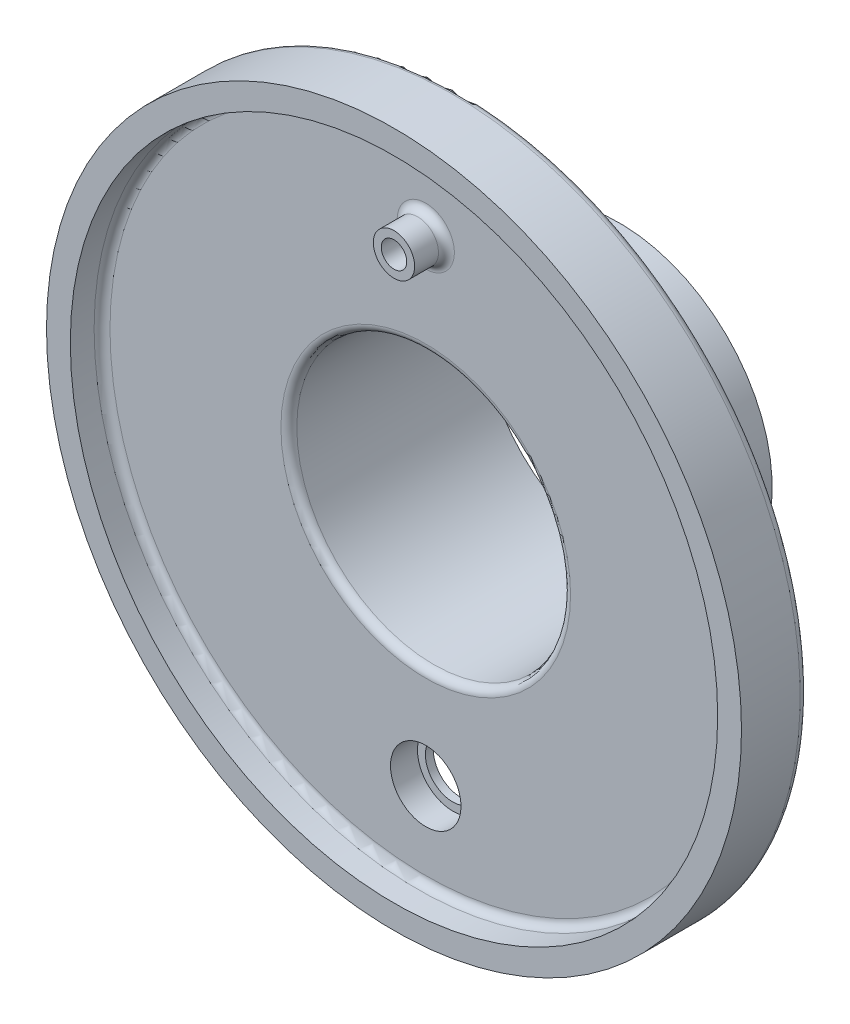
ISO-10303-21;
HEADER;
FILE_DESCRIPTION(('STEP AP214'),'2;1');
FILE_NAME('part.step','',(''),(''),'','','');
FILE_SCHEMA(('AUTOMOTIVE_DESIGN { 1 0 10303 214 1 1 1 1 }'));
ENDSEC;
DATA;
#1=APPLICATION_CONTEXT('core data for automotive mechanical design processes');
#2=APPLICATION_PROTOCOL_DEFINITION('international standard','automotive_design',2000,#1);
#3=PRODUCT_CONTEXT('',#1,'mechanical');
#4=PRODUCT('Part','Part','',(#3));
#5=PRODUCT_RELATED_PRODUCT_CATEGORY('part','',(#4));
#6=PRODUCT_DEFINITION_FORMATION('','',#4);
#7=PRODUCT_DEFINITION_CONTEXT('part definition',#1,'design');
#8=PRODUCT_DEFINITION('design','',#6,#7);
#9=PRODUCT_DEFINITION_SHAPE('','',#8);
#10=(LENGTH_UNIT() NAMED_UNIT(*) SI_UNIT(.MILLI.,.METRE.));
#11=(NAMED_UNIT(*) PLANE_ANGLE_UNIT() SI_UNIT($,.RADIAN.));
#12=(NAMED_UNIT(*) SI_UNIT($,.STERADIAN.) SOLID_ANGLE_UNIT());
#13=UNCERTAINTY_MEASURE_WITH_UNIT(LENGTH_MEASURE(1.E-05),#10,'distance_accuracy_value','');
#14=(GEOMETRIC_REPRESENTATION_CONTEXT(3) GLOBAL_UNCERTAINTY_ASSIGNED_CONTEXT((#13)) GLOBAL_UNIT_ASSIGNED_CONTEXT((#10,
#11,#12)) REPRESENTATION_CONTEXT('',''));
#15=CARTESIAN_POINT('',(0.,0.,0.));
#16=DIRECTION('',(0.,0.,1.));
#17=DIRECTION('',(1.,0.,0.));
#18=AXIS2_PLACEMENT_3D('',#15,#16,#17);
#19=CARTESIAN_POINT('',(0.,-76.2,39.624));
#20=DIRECTION('',(0.,0.,-1.));
#21=DIRECTION('',(-1.,0.,0.));
#22=AXIS2_PLACEMENT_3D('',#19,#20,#21);
#23=CYLINDRICAL_SURFACE('',#22,11.2776);
#24=CARTESIAN_POINT('',(0.,-76.2,0.));
#25=DIRECTION('',(0.,0.,-1.));
#26=DIRECTION('',(-1.,0.,0.));
#27=AXIS2_PLACEMENT_3D('',#24,#25,#26);
#28=CIRCLE('',#27,11.2776);
#29=CARTESIAN_POINT('',(-11.2776,-76.2,0.));
#30=VERTEX_POINT('',#29);
#31=EDGE_CURVE('E77',#30,#30,#28,.T.);
#32=ORIENTED_EDGE('',*,*,#31,.F.);
#33=EDGE_LOOP('',(#32));
#34=FACE_BOUND('',#33,.T.);
#35=CARTESIAN_POINT('',(0.,-76.2,-8.636));
#36=DIRECTION('',(0.,0.,-1.));
#37=DIRECTION('',(-1.,0.,0.));
#38=AXIS2_PLACEMENT_3D('',#35,#36,#37);
#39=CIRCLE('',#38,11.2776);
#40=CARTESIAN_POINT('',(-11.2776,-76.2,-8.636));
#41=VERTEX_POINT('',#40);
#42=EDGE_CURVE('E11',#41,#41,#39,.F.);
#43=ORIENTED_EDGE('',*,*,#42,.F.);
#44=EDGE_LOOP('',(#43));
#45=FACE_BOUND('',#44,.T.);
#46=ADVANCED_FACE('F46',(#34,#45),#23,.F.);
#47=CARTESIAN_POINT('',(0.,0.,-11.176));
#48=DIRECTION('',(0.,0.,-1.));
#49=DIRECTION('',(-1.,0.,0.));
#50=AXIS2_PLACEMENT_3D('',#47,#48,#49);
#51=PLANE('',#50);
#52=CARTESIAN_POINT('',(0.,0.,-11.176));
#53=DIRECTION('',(0.,0.,-1.));
#54=DIRECTION('',(-1.,0.,0.));
#55=AXIS2_PLACEMENT_3D('',#52,#53,#54);
#56=CIRCLE('',#55,51.435);
#57=CARTESIAN_POINT('',(-51.435,0.,-11.176));
#58=VERTEX_POINT('',#57);
#59=EDGE_CURVE('E95',#58,#58,#56,.F.);
#60=ORIENTED_EDGE('',*,*,#59,.T.);
#61=EDGE_LOOP('',(#60));
#62=FACE_BOUND('',#61,.T.);
#63=CARTESIAN_POINT('',(0.,0.,-11.176));
#64=DIRECTION('',(0.,0.,-1.));
#65=DIRECTION('',(-1.,0.,0.));
#66=AXIS2_PLACEMENT_3D('',#63,#64,#65);
#67=CIRCLE('',#66,108.6739);
#68=CARTESIAN_POINT('',(-108.6739,0.,-11.176));
#69=VERTEX_POINT('',#68);
#70=EDGE_CURVE('E99',#69,#69,#67,.T.);
#71=ORIENTED_EDGE('',*,*,#70,.T.);
#72=EDGE_LOOP('',(#71));
#73=FACE_BOUND('',#72,.T.);
#74=CARTESIAN_POINT('',(0.,-76.2,-11.176));
#75=DIRECTION('',(0.,0.,-1.));
#76=DIRECTION('',(-1.,0.,0.));
#77=AXIS2_PLACEMENT_3D('',#74,#75,#76);
#78=CIRCLE('',#77,8.7376);
#79=CARTESIAN_POINT('',(-8.7376,-76.2,-11.176));
#80=VERTEX_POINT('',#79);
#81=EDGE_CURVE('E119',#80,#80,#78,.T.);
#82=ORIENTED_EDGE('',*,*,#81,.F.);
#83=EDGE_LOOP('',(#82));
#84=FACE_BOUND('',#83,.T.);
#85=ADVANCED_FACE('F142',(#62,#73,#84),#51,.T.);
#86=CARTESIAN_POINT('',(0.,0.,10.16));
#87=DIRECTION('',(0.,0.,1.));
#88=DIRECTION('',(1.,0.,0.));
#89=AXIS2_PLACEMENT_3D('',#86,#87,#88);
#90=PLANE('',#89);
#91=CARTESIAN_POINT('',(0.,0.,10.16));
#92=DIRECTION('',(0.,0.,1.));
#93=DIRECTION('',(1.,0.,0.));
#94=AXIS2_PLACEMENT_3D('',#91,#92,#93);
#95=CIRCLE('',#94,111.2139);
#96=CARTESIAN_POINT('',(111.2139,0.,10.16));
#97=VERTEX_POINT('',#96);
#98=EDGE_CURVE('E219',#97,#97,#95,.T.);
#99=ORIENTED_EDGE('',*,*,#98,.T.);
#100=EDGE_LOOP('',(#99));
#101=FACE_BOUND('',#100,.T.);
#102=CARTESIAN_POINT('',(0.,0.,10.16));
#103=DIRECTION('',(0.,0.,1.));
#104=DIRECTION('',(1.,0.,0.));
#105=AXIS2_PLACEMENT_3D('',#102,#103,#104);
#106=CIRCLE('',#105,103.5939);
#107=CARTESIAN_POINT('',(103.5939,0.,10.16));
#108=VERTEX_POINT('',#107);
#109=EDGE_CURVE('E225',#108,#108,#106,.T.);
#110=ORIENTED_EDGE('',*,*,#109,.F.);
#111=EDGE_LOOP('',(#110));
#112=FACE_BOUND('',#111,.T.);
#113=ADVANCED_FACE('F144',(#101,#112),#90,.T.);
#114=CARTESIAN_POINT('',(0.,0.,10.16));
#115=DIRECTION('',(0.,0.,-1.));
#116=DIRECTION('',(-1.,0.,0.));
#117=AXIS2_PLACEMENT_3D('',#114,#115,#116);
#118=CYLINDRICAL_SURFACE('',#117,111.2139);
#119=CARTESIAN_POINT('',(0.,0.,-8.636));
#120=DIRECTION('',(0.,0.,-1.));
#121=DIRECTION('',(-1.,0.,0.));
#122=AXIS2_PLACEMENT_3D('',#119,#120,#121);
#123=CIRCLE('',#122,111.2139);
#124=CARTESIAN_POINT('',(-111.2139,0.,-8.636));
#125=VERTEX_POINT('',#124);
#126=EDGE_CURVE('E91',#125,#125,#123,.F.);
#127=ORIENTED_EDGE('',*,*,#126,.T.);
#128=EDGE_LOOP('',(#127));
#129=FACE_BOUND('',#128,.T.);
#130=ORIENTED_EDGE('',*,*,#98,.F.);
#131=EDGE_LOOP('',(#130));
#132=FACE_BOUND('',#131,.T.);
#133=ADVANCED_FACE('F151',(#129,#132),#118,.T.);
#134=CARTESIAN_POINT('',(0.,0.,10.16));
#135=DIRECTION('',(0.,0.,-1.));
#136=DIRECTION('',(-1.,0.,0.));
#137=AXIS2_PLACEMENT_3D('',#134,#135,#136);
#138=CYLINDRICAL_SURFACE('',#137,103.5939);
#139=CARTESIAN_POINT('',(0.,0.,2.54));
#140=DIRECTION('',(0.,0.,-1.));
#141=DIRECTION('',(-1.,0.,0.));
#142=AXIS2_PLACEMENT_3D('',#139,#140,#141);
#143=CIRCLE('',#142,103.5939);
#144=CARTESIAN_POINT('',(-103.5939,0.,2.54));
#145=VERTEX_POINT('',#144);
#146=EDGE_CURVE('E218',#145,#145,#143,.T.);
#147=ORIENTED_EDGE('',*,*,#146,.T.);
#148=EDGE_LOOP('',(#147));
#149=FACE_BOUND('',#148,.T.);
#150=ORIENTED_EDGE('',*,*,#109,.T.);
#151=EDGE_LOOP('',(#150));
#152=FACE_BOUND('',#151,.T.);
#153=ADVANCED_FACE('F171',(#149,#152),#138,.F.);
#154=CARTESIAN_POINT('',(0.,0.,0.));
#155=DIRECTION('',(0.,0.,-1.));
#156=DIRECTION('',(-1.,0.,0.));
#157=AXIS2_PLACEMENT_3D('',#154,#155,#156);
#158=PLANE('',#157);
#159=CARTESIAN_POINT('',(0.,76.2,0.));
#160=DIRECTION('',(0.,0.,-1.));
#161=DIRECTION('',(-1.,0.,0.));
#162=AXIS2_PLACEMENT_3D('',#159,#160,#161);
#163=CIRCLE('',#162,9.1567);
#164=CARTESIAN_POINT('',(-9.1567,76.2,0.));
#165=VERTEX_POINT('',#164);
#166=EDGE_CURVE('E55',#165,#165,#163,.T.);
#167=ORIENTED_EDGE('',*,*,#166,.T.);
#168=EDGE_LOOP('',(#167));
#169=FACE_BOUND('',#168,.T.);
#170=ORIENTED_EDGE('',*,*,#31,.T.);
#171=EDGE_LOOP('',(#170));
#172=FACE_BOUND('',#171,.T.);
#173=CARTESIAN_POINT('',(0.,0.,0.));
#174=DIRECTION('',(0.,0.,-1.));
#175=DIRECTION('',(-1.,0.,0.));
#176=AXIS2_PLACEMENT_3D('',#173,#174,#175);
#177=CIRCLE('',#176,46.355);
#178=CARTESIAN_POINT('',(-46.355,0.,0.));
#179=VERTEX_POINT('',#178);
#180=EDGE_CURVE('E86',#179,#179,#177,.T.);
#181=ORIENTED_EDGE('',*,*,#180,.T.);
#182=EDGE_LOOP('',(#181));
#183=FACE_BOUND('',#182,.T.);
#184=CARTESIAN_POINT('',(0.,0.,0.));
#185=DIRECTION('',(0.,0.,-1.));
#186=DIRECTION('',(-1.,0.,0.));
#187=AXIS2_PLACEMENT_3D('',#184,#185,#186);
#188=CIRCLE('',#187,101.0539);
#189=CARTESIAN_POINT('',(-101.0539,0.,0.));
#190=VERTEX_POINT('',#189);
#191=EDGE_CURVE('E215',#190,#190,#188,.F.);
#192=ORIENTED_EDGE('',*,*,#191,.T.);
#193=EDGE_LOOP('',(#192));
#194=FACE_BOUND('',#193,.T.);
#195=ADVANCED_FACE('F166',(#169,#172,#183,#194),#158,.F.);
#196=CARTESIAN_POINT('',(0.,0.,-11.176));
#197=DIRECTION('',(0.,0.,1.));
#198=DIRECTION('',(1.,0.,0.));
#199=AXIS2_PLACEMENT_3D('',#196,#197,#198);
#200=CYLINDRICAL_SURFACE('',#199,43.815);
#201=CARTESIAN_POINT('',(0.,0.,-2.54));
#202=DIRECTION('',(0.,0.,-1.));
#203=DIRECTION('',(-1.,0.,0.));
#204=AXIS2_PLACEMENT_3D('',#201,#202,#203);
#205=CIRCLE('',#204,43.815);
#206=CARTESIAN_POINT('',(-43.815,0.,-2.54));
#207=VERTEX_POINT('',#206);
#208=EDGE_CURVE('E65',#207,#207,#205,.F.);
#209=ORIENTED_EDGE('',*,*,#208,.T.);
#210=EDGE_LOOP('',(#209));
#211=FACE_BOUND('',#210,.T.);
#212=CARTESIAN_POINT('',(0.,0.,-61.976));
#213=DIRECTION('',(0.,0.,-1.));
#214=DIRECTION('',(-1.,0.,0.));
#215=AXIS2_PLACEMENT_3D('',#212,#213,#214);
#216=CIRCLE('',#215,43.815);
#217=CARTESIAN_POINT('',(-43.815,0.,-61.976));
#218=VERTEX_POINT('',#217);
#219=EDGE_CURVE('E82',#218,#218,#216,.T.);
#220=ORIENTED_EDGE('',*,*,#219,.T.);
#221=EDGE_LOOP('',(#220));
#222=FACE_BOUND('',#221,.T.);
#223=ADVANCED_FACE('F163',(#211,#222),#200,.F.);
#224=CARTESIAN_POINT('',(0.,0.,-61.976));
#225=DIRECTION('',(0.,0.,-1.));
#226=DIRECTION('',(-1.,0.,0.));
#227=AXIS2_PLACEMENT_3D('',#224,#225,#226);
#228=PLANE('',#227);
#229=CARTESIAN_POINT('',(0.,0.,-61.976));
#230=DIRECTION('',(0.,0.,-1.));
#231=DIRECTION('',(-1.,0.,0.));
#232=AXIS2_PLACEMENT_3D('',#229,#230,#231);
#233=CIRCLE('',#232,48.895);
#234=CARTESIAN_POINT('',(-48.895,0.,-61.976));
#235=VERTEX_POINT('',#234);
#236=EDGE_CURVE('E235',#235,#235,#233,.T.);
#237=ORIENTED_EDGE('',*,*,#236,.T.);
#238=EDGE_LOOP('',(#237));
#239=FACE_BOUND('',#238,.T.);
#240=ORIENTED_EDGE('',*,*,#219,.F.);
#241=EDGE_LOOP('',(#240));
#242=FACE_BOUND('',#241,.T.);
#243=ADVANCED_FACE('F247',(#239,#242),#228,.T.);
#244=CARTESIAN_POINT('',(0.,0.,-61.976));
#245=DIRECTION('',(0.,0.,1.));
#246=DIRECTION('',(1.,0.,0.));
#247=AXIS2_PLACEMENT_3D('',#244,#245,#246);
#248=CYLINDRICAL_SURFACE('',#247,48.895);
#249=CARTESIAN_POINT('',(0.,0.,-13.716));
#250=DIRECTION('',(0.,0.,-1.));
#251=DIRECTION('',(-1.,0.,0.));
#252=AXIS2_PLACEMENT_3D('',#249,#250,#251);
#253=CIRCLE('',#252,48.895);
#254=CARTESIAN_POINT('',(-48.895,0.,-13.716));
#255=VERTEX_POINT('',#254);
#256=EDGE_CURVE('E104',#255,#255,#253,.T.);
#257=ORIENTED_EDGE('',*,*,#256,.T.);
#258=EDGE_LOOP('',(#257));
#259=FACE_BOUND('',#258,.T.);
#260=ORIENTED_EDGE('',*,*,#236,.F.);
#261=EDGE_LOOP('',(#260));
#262=FACE_BOUND('',#261,.T.);
#263=ADVANCED_FACE('F187',(#259,#262),#248,.T.);
#264=CARTESIAN_POINT('',(0.,0.,2.54));
#265=DIRECTION('',(0.,0.,-1.));
#266=DIRECTION('',(-1.,0.,0.));
#267=AXIS2_PLACEMENT_3D('',#264,#265,#266);
#268=TOROIDAL_SURFACE('',#267,101.0539,2.54);
#269=ORIENTED_EDGE('',*,*,#146,.F.);
#270=EDGE_LOOP('',(#269));
#271=FACE_BOUND('',#270,.T.);
#272=ORIENTED_EDGE('',*,*,#191,.F.);
#273=EDGE_LOOP('',(#272));
#274=FACE_BOUND('',#273,.T.);
#275=ADVANCED_FACE('F182',(#271,#274),#268,.F.);
#276=CARTESIAN_POINT('',(0.,0.,-13.716));
#277=DIRECTION('',(0.,0.,-1.));
#278=DIRECTION('',(-1.,0.,0.));
#279=AXIS2_PLACEMENT_3D('',#276,#277,#278);
#280=TOROIDAL_SURFACE('',#279,51.435,2.54);
#281=ORIENTED_EDGE('',*,*,#59,.F.);
#282=EDGE_LOOP('',(#281));
#283=FACE_BOUND('',#282,.T.);
#284=ORIENTED_EDGE('',*,*,#256,.F.);
#285=EDGE_LOOP('',(#284));
#286=FACE_BOUND('',#285,.T.);
#287=ADVANCED_FACE('F186',(#283,#286),#280,.F.);
#288=CARTESIAN_POINT('',(0.,0.,-8.636));
#289=DIRECTION('',(0.,0.,-1.));
#290=DIRECTION('',(-1.,0.,0.));
#291=AXIS2_PLACEMENT_3D('',#288,#289,#290);
#292=TOROIDAL_SURFACE('',#291,108.6739,2.54);
#293=ORIENTED_EDGE('',*,*,#126,.F.);
#294=EDGE_LOOP('',(#293));
#295=FACE_BOUND('',#294,.T.);
#296=ORIENTED_EDGE('',*,*,#70,.F.);
#297=EDGE_LOOP('',(#296));
#298=FACE_BOUND('',#297,.T.);
#299=ADVANCED_FACE('F192',(#295,#298),#292,.T.);
#300=CARTESIAN_POINT('',(0.,0.,-2.54));
#301=DIRECTION('',(0.,0.,-1.));
#302=DIRECTION('',(-1.,0.,0.));
#303=AXIS2_PLACEMENT_3D('',#300,#301,#302);
#304=TOROIDAL_SURFACE('',#303,46.355,2.54);
#305=ORIENTED_EDGE('',*,*,#208,.F.);
#306=EDGE_LOOP('',(#305));
#307=FACE_BOUND('',#306,.T.);
#308=ORIENTED_EDGE('',*,*,#180,.F.);
#309=EDGE_LOOP('',(#308));
#310=FACE_BOUND('',#309,.T.);
#311=ADVANCED_FACE('F195',(#307,#310),#304,.T.);
#312=CARTESIAN_POINT('',(0.,76.2,10.16));
#313=DIRECTION('',(0.,0.,-1.));
#314=DIRECTION('',(-1.,0.,0.));
#315=AXIS2_PLACEMENT_3D('',#312,#313,#314);
#316=CYLINDRICAL_SURFACE('',#315,4.0767);
#317=CARTESIAN_POINT('',(0.,76.2,10.16));
#318=DIRECTION('',(0.,0.,1.));
#319=DIRECTION('',(1.,0.,0.));
#320=AXIS2_PLACEMENT_3D('',#317,#318,#319);
#321=CIRCLE('',#320,4.0767);
#322=CARTESIAN_POINT('',(4.0767,76.2,10.16));
#323=VERTEX_POINT('',#322);
#324=EDGE_CURVE('E112',#323,#323,#321,.T.);
#325=ORIENTED_EDGE('',*,*,#324,.T.);
#326=EDGE_LOOP('',(#325));
#327=FACE_BOUND('',#326,.T.);
#328=CARTESIAN_POINT('',(0.,76.2,0.));
#329=DIRECTION('',(0.,0.,1.));
#330=DIRECTION('',(1.,0.,0.));
#331=AXIS2_PLACEMENT_3D('',#328,#329,#330);
#332=CIRCLE('',#331,4.0767);
#333=CARTESIAN_POINT('',(4.0767,76.2,0.));
#334=VERTEX_POINT('',#333);
#335=EDGE_CURVE('E118',#334,#334,#332,.T.);
#336=ORIENTED_EDGE('',*,*,#335,.F.);
#337=EDGE_LOOP('',(#336));
#338=FACE_BOUND('',#337,.T.);
#339=ADVANCED_FACE('F200',(#327,#338),#316,.F.);
#340=CARTESIAN_POINT('',(0.,76.2,10.16));
#341=DIRECTION('',(0.,0.,-1.));
#342=DIRECTION('',(-1.,0.,0.));
#343=AXIS2_PLACEMENT_3D('',#340,#341,#342);
#344=CYLINDRICAL_SURFACE('',#343,6.6167);
#345=CARTESIAN_POINT('',(0.,76.2,2.54));
#346=DIRECTION('',(0.,0.,-1.));
#347=DIRECTION('',(-1.,0.,0.));
#348=AXIS2_PLACEMENT_3D('',#345,#346,#347);
#349=CIRCLE('',#348,6.6167);
#350=CARTESIAN_POINT('',(-6.6167,76.2,2.54));
#351=VERTEX_POINT('',#350);
#352=EDGE_CURVE('E60',#351,#351,#349,.F.);
#353=ORIENTED_EDGE('',*,*,#352,.T.);
#354=EDGE_LOOP('',(#353));
#355=FACE_BOUND('',#354,.T.);
#356=CARTESIAN_POINT('',(0.,76.2,10.16));
#357=DIRECTION('',(0.,0.,1.));
#358=DIRECTION('',(1.,0.,0.));
#359=AXIS2_PLACEMENT_3D('',#356,#357,#358);
#360=CIRCLE('',#359,6.6167);
#361=CARTESIAN_POINT('',(6.6167,76.2,10.16));
#362=VERTEX_POINT('',#361);
#363=EDGE_CURVE('E83',#362,#362,#360,.T.);
#364=ORIENTED_EDGE('',*,*,#363,.F.);
#365=EDGE_LOOP('',(#364));
#366=FACE_BOUND('',#365,.T.);
#367=ADVANCED_FACE('F205',(#355,#366),#344,.T.);
#368=CARTESIAN_POINT('',(0.,0.,10.16));
#369=DIRECTION('',(0.,0.,1.));
#370=DIRECTION('',(1.,0.,0.));
#371=AXIS2_PLACEMENT_3D('',#368,#369,#370);
#372=PLANE('',#371);
#373=ORIENTED_EDGE('',*,*,#324,.F.);
#374=EDGE_LOOP('',(#373));
#375=FACE_BOUND('',#374,.T.);
#376=ORIENTED_EDGE('',*,*,#363,.T.);
#377=EDGE_LOOP('',(#376));
#378=FACE_BOUND('',#377,.T.);
#379=ADVANCED_FACE('F262',(#375,#378),#372,.T.);
#380=ORIENTED_EDGE('',*,*,#335,.T.);
#381=EDGE_LOOP('',(#380));
#382=FACE_BOUND('',#381,.T.);
#383=ADVANCED_FACE('F172',(#382),#158,.F.);
#384=CARTESIAN_POINT('',(0.,76.2,2.54));
#385=DIRECTION('',(0.,0.,-1.));
#386=DIRECTION('',(-1.,0.,0.));
#387=AXIS2_PLACEMENT_3D('',#384,#385,#386);
#388=TOROIDAL_SURFACE('',#387,9.1567,2.54);
#389=ORIENTED_EDGE('',*,*,#166,.F.);
#390=EDGE_LOOP('',(#389));
#391=FACE_BOUND('',#390,.T.);
#392=ORIENTED_EDGE('',*,*,#352,.F.);
#393=EDGE_LOOP('',(#392));
#394=FACE_BOUND('',#393,.T.);
#395=ADVANCED_FACE('F49',(#391,#394),#388,.F.);
#396=CARTESIAN_POINT('',(0.,-76.2,-8.636));
#397=DIRECTION('',(0.,0.,-1.));
#398=DIRECTION('',(-1.,0.,0.));
#399=AXIS2_PLACEMENT_3D('',#396,#397,#398);
#400=PLANE('',#399);
#401=CARTESIAN_POINT('',(0.,-76.2,-8.636));
#402=DIRECTION('',(0.,0.,-1.));
#403=DIRECTION('',(-1.,0.,0.));
#404=AXIS2_PLACEMENT_3D('',#401,#402,#403);
#405=CIRCLE('',#404,8.7376);
#406=CARTESIAN_POINT('',(-8.7376,-76.2,-8.636));
#407=VERTEX_POINT('',#406);
#408=EDGE_CURVE('E128',#407,#407,#405,.T.);
#409=ORIENTED_EDGE('',*,*,#408,.T.);
#410=EDGE_LOOP('',(#409));
#411=FACE_BOUND('',#410,.T.);
#412=ORIENTED_EDGE('',*,*,#42,.T.);
#413=EDGE_LOOP('',(#412));
#414=FACE_BOUND('',#413,.T.);
#415=ADVANCED_FACE('F269',(#411,#414),#400,.F.);
#416=CARTESIAN_POINT('',(0.,-76.2,-8.636));
#417=DIRECTION('',(0.,0.,-1.));
#418=DIRECTION('',(-1.,0.,0.));
#419=AXIS2_PLACEMENT_3D('',#416,#417,#418);
#420=CYLINDRICAL_SURFACE('',#419,8.7376);
#421=ORIENTED_EDGE('',*,*,#408,.F.);
#422=EDGE_LOOP('',(#421));
#423=FACE_BOUND('',#422,.T.);
#424=ORIENTED_EDGE('',*,*,#81,.T.);
#425=EDGE_LOOP('',(#424));
#426=FACE_BOUND('',#425,.T.);
#427=ADVANCED_FACE('F140',(#423,#426),#420,.F.);
#428=CLOSED_SHELL('',(#46,#85,#113,#133,#153,#195,#223,#243,#263,#275,#287,#299,#311,#339,#367,
#379,#383,#395,#415,#427));
#429=MANIFOLD_SOLID_BREP('B2',#428);
#430=ADVANCED_BREP_SHAPE_REPRESENTATION('',(#18,#429),#14);
#431=SHAPE_DEFINITION_REPRESENTATION(#9,#430);
ENDSEC;
END-ISO-10303-21;
